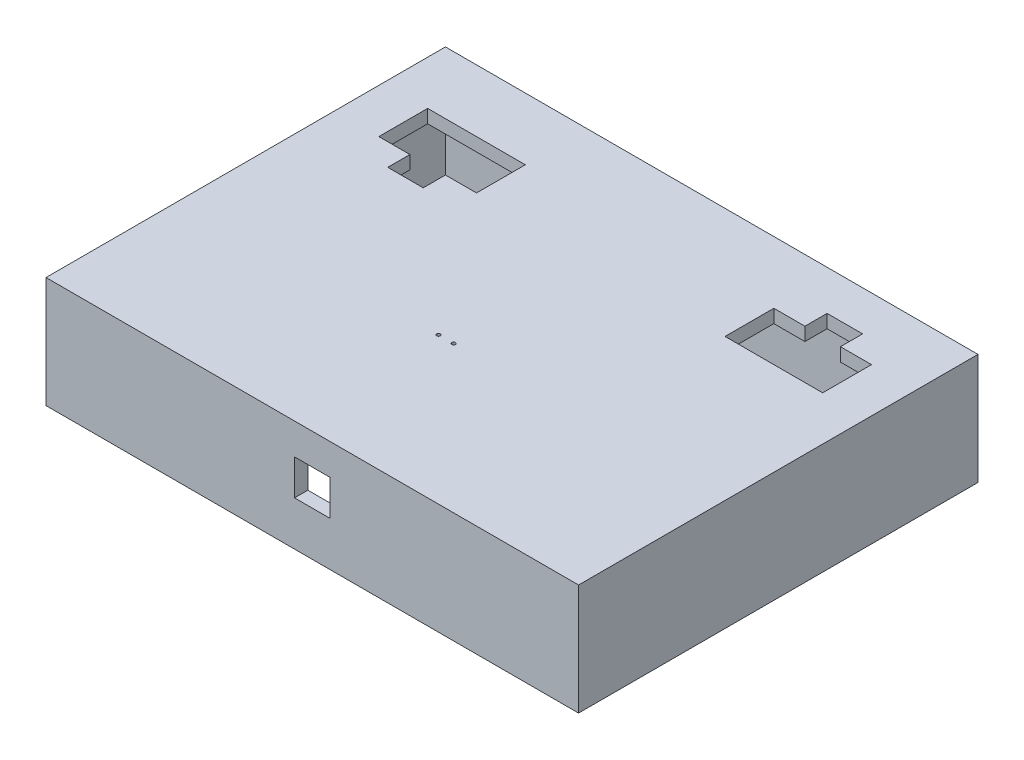
ISO-10303-21;
HEADER;
FILE_DESCRIPTION(('STEP AP214'),'2;1');
FILE_NAME('part.step','',(''),(''),'','','');
FILE_SCHEMA(('AUTOMOTIVE_DESIGN { 1 0 10303 214 1 1 1 1 }'));
ENDSEC;
DATA;
#1=APPLICATION_CONTEXT('core data for automotive mechanical design processes');
#2=APPLICATION_PROTOCOL_DEFINITION('international standard','automotive_design',2000,#1);
#3=PRODUCT_CONTEXT('',#1,'mechanical');
#4=PRODUCT('Part','Part','',(#3));
#5=PRODUCT_RELATED_PRODUCT_CATEGORY('part','',(#4));
#6=PRODUCT_DEFINITION_FORMATION('','',#4);
#7=PRODUCT_DEFINITION_CONTEXT('part definition',#1,'design');
#8=PRODUCT_DEFINITION('design','',#6,#7);
#9=PRODUCT_DEFINITION_SHAPE('','',#8);
#10=(LENGTH_UNIT() NAMED_UNIT(*) SI_UNIT(.MILLI.,.METRE.));
#11=(NAMED_UNIT(*) PLANE_ANGLE_UNIT() SI_UNIT($,.RADIAN.));
#12=(NAMED_UNIT(*) SI_UNIT($,.STERADIAN.) SOLID_ANGLE_UNIT());
#13=UNCERTAINTY_MEASURE_WITH_UNIT(LENGTH_MEASURE(1.E-05),#10,'distance_accuracy_value','');
#14=(GEOMETRIC_REPRESENTATION_CONTEXT(3) GLOBAL_UNCERTAINTY_ASSIGNED_CONTEXT((#13)) GLOBAL_UNIT_ASSIGNED_CONTEXT((#10,
#11,#12)) REPRESENTATION_CONTEXT('',''));
#15=CARTESIAN_POINT('',(0.,0.,0.));
#16=DIRECTION('',(0.,0.,1.));
#17=DIRECTION('',(1.,0.,0.));
#18=AXIS2_PLACEMENT_3D('',#15,#16,#17);
#19=CARTESIAN_POINT('',(60.,25.,-45.));
#20=DIRECTION('',(-1.,0.,0.));
#21=DIRECTION('',(0.,0.,1.));
#22=AXIS2_PLACEMENT_3D('',#19,#20,#21);
#23=PLANE('',#22);
#24=DIRECTION('',(0.,0.,-1.));
#25=VECTOR('',#24,1.);
#26=CARTESIAN_POINT('',(60.,0.,-45.));
#27=LINE('',#26,#25);
#28=CARTESIAN_POINT('',(60.,0.,45.));
#29=VERTEX_POINT('',#28);
#30=CARTESIAN_POINT('',(60.,0.,-45.));
#31=VERTEX_POINT('',#30);
#32=EDGE_CURVE('E408',#29,#31,#27,.T.);
#33=ORIENTED_EDGE('',*,*,#32,.T.);
#34=DIRECTION('',(0.,-1.,0.));
#35=VECTOR('',#34,1.);
#36=CARTESIAN_POINT('',(60.,25.,-45.));
#37=LINE('',#36,#35);
#38=CARTESIAN_POINT('',(60.,25.,-45.));
#39=VERTEX_POINT('',#38);
#40=EDGE_CURVE('E443',#39,#31,#37,.T.);
#41=ORIENTED_EDGE('',*,*,#40,.F.);
#42=DIRECTION('',(0.,0.,-1.));
#43=VECTOR('',#42,1.);
#44=CARTESIAN_POINT('',(60.,25.,-45.));
#45=LINE('',#44,#43);
#46=CARTESIAN_POINT('',(60.,25.,45.));
#47=VERTEX_POINT('',#46);
#48=EDGE_CURVE('E417',#47,#39,#45,.T.);
#49=ORIENTED_EDGE('',*,*,#48,.F.);
#50=DIRECTION('',(0.,-1.,0.));
#51=VECTOR('',#50,1.);
#52=CARTESIAN_POINT('',(60.,25.,45.));
#53=LINE('',#52,#51);
#54=EDGE_CURVE('E427',#47,#29,#53,.T.);
#55=ORIENTED_EDGE('',*,*,#54,.T.);
#56=EDGE_LOOP('',(#33,#41,#49,#55));
#57=FACE_BOUND('',#56,.T.);
#58=ADVANCED_FACE('F33',(#57),#23,.F.);
#59=CARTESIAN_POINT('',(-60.,25.,-45.));
#60=DIRECTION('',(0.,0.,1.));
#61=DIRECTION('',(1.,0.,0.));
#62=AXIS2_PLACEMENT_3D('',#59,#60,#61);
#63=PLANE('',#62);
#64=DIRECTION('',(-1.,0.,0.));
#65=VECTOR('',#64,1.);
#66=CARTESIAN_POINT('',(-60.,0.,-45.));
#67=LINE('',#66,#65);
#68=CARTESIAN_POINT('',(-60.,0.,-45.));
#69=VERTEX_POINT('',#68);
#70=EDGE_CURVE('E430',#31,#69,#67,.T.);
#71=ORIENTED_EDGE('',*,*,#70,.T.);
#72=DIRECTION('',(0.,-1.,0.));
#73=VECTOR('',#72,1.);
#74=CARTESIAN_POINT('',(-60.,25.,-45.));
#75=LINE('',#74,#73);
#76=CARTESIAN_POINT('',(-60.,25.,-45.));
#77=VERTEX_POINT('',#76);
#78=EDGE_CURVE('E440',#77,#69,#75,.T.);
#79=ORIENTED_EDGE('',*,*,#78,.F.);
#80=DIRECTION('',(-1.,0.,0.));
#81=VECTOR('',#80,1.);
#82=CARTESIAN_POINT('',(-60.,25.,-45.));
#83=LINE('',#82,#81);
#84=EDGE_CURVE('E420',#39,#77,#83,.T.);
#85=ORIENTED_EDGE('',*,*,#84,.F.);
#86=ORIENTED_EDGE('',*,*,#40,.T.);
#87=EDGE_LOOP('',(#71,#79,#85,#86));
#88=FACE_BOUND('',#87,.T.);
#89=ADVANCED_FACE('F526',(#88),#63,.F.);
#90=CARTESIAN_POINT('',(-60.,25.,-45.));
#91=DIRECTION('',(1.,0.,0.));
#92=DIRECTION('',(0.,0.,-1.));
#93=AXIS2_PLACEMENT_3D('',#90,#91,#92);
#94=PLANE('',#93);
#95=DIRECTION('',(0.,0.,1.));
#96=VECTOR('',#95,1.);
#97=CARTESIAN_POINT('',(-60.,0.,-45.));
#98=LINE('',#97,#96);
#99=CARTESIAN_POINT('',(-60.,0.,45.));
#100=VERTEX_POINT('',#99);
#101=EDGE_CURVE('E432',#69,#100,#98,.T.);
#102=ORIENTED_EDGE('',*,*,#101,.T.);
#103=DIRECTION('',(0.,-1.,0.));
#104=VECTOR('',#103,1.);
#105=CARTESIAN_POINT('',(-60.,25.,45.));
#106=LINE('',#105,#104);
#107=CARTESIAN_POINT('',(-60.,25.,45.));
#108=VERTEX_POINT('',#107);
#109=EDGE_CURVE('E437',#108,#100,#106,.T.);
#110=ORIENTED_EDGE('',*,*,#109,.F.);
#111=DIRECTION('',(0.,0.,1.));
#112=VECTOR('',#111,1.);
#113=CARTESIAN_POINT('',(-60.,25.,-45.));
#114=LINE('',#113,#112);
#115=EDGE_CURVE('E423',#77,#108,#114,.T.);
#116=ORIENTED_EDGE('',*,*,#115,.F.);
#117=ORIENTED_EDGE('',*,*,#78,.T.);
#118=EDGE_LOOP('',(#102,#110,#116,#117));
#119=FACE_BOUND('',#118,.T.);
#120=ADVANCED_FACE('F531',(#119),#94,.F.);
#121=CARTESIAN_POINT('',(-60.,25.,45.));
#122=DIRECTION('',(0.,0.,-1.));
#123=DIRECTION('',(-1.,0.,0.));
#124=AXIS2_PLACEMENT_3D('',#121,#122,#123);
#125=PLANE('',#124);
#126=DIRECTION('',(-1.,0.,0.));
#127=VECTOR('',#126,1.);
#128=CARTESIAN_POINT('',(-4.,18.,45.));
#129=LINE('',#128,#127);
#130=CARTESIAN_POINT('',(3.99999999999999,18.,45.));
#131=VERTEX_POINT('',#130);
#132=CARTESIAN_POINT('',(-4.,18.,45.));
#133=VERTEX_POINT('',#132);
#134=EDGE_CURVE('E255',#131,#133,#129,.T.);
#135=ORIENTED_EDGE('',*,*,#134,.F.);
#136=DIRECTION('',(0.,1.,0.));
#137=VECTOR('',#136,1.);
#138=CARTESIAN_POINT('',(4.,18.,45.));
#139=LINE('',#138,#137);
#140=CARTESIAN_POINT('',(4.,10.,45.));
#141=VERTEX_POINT('',#140);
#142=EDGE_CURVE('E49',#141,#131,#139,.T.);
#143=ORIENTED_EDGE('',*,*,#142,.F.);
#144=DIRECTION('',(1.,0.,0.));
#145=VECTOR('',#144,1.);
#146=CARTESIAN_POINT('',(-4.,10.,45.));
#147=LINE('',#146,#145);
#148=CARTESIAN_POINT('',(-4.,10.,45.));
#149=VERTEX_POINT('',#148);
#150=EDGE_CURVE('E262',#149,#141,#147,.T.);
#151=ORIENTED_EDGE('',*,*,#150,.F.);
#152=DIRECTION('',(0.,-1.,0.));
#153=VECTOR('',#152,1.);
#154=CARTESIAN_POINT('',(-4.,18.,45.));
#155=LINE('',#154,#153);
#156=EDGE_CURVE('E246',#133,#149,#155,.T.);
#157=ORIENTED_EDGE('',*,*,#156,.F.);
#158=EDGE_LOOP('',(#135,#143,#151,#157));
#159=FACE_BOUND('',#158,.T.);
#160=DIRECTION('',(1.,0.,0.));
#161=VECTOR('',#160,1.);
#162=CARTESIAN_POINT('',(-60.,0.,45.));
#163=LINE('',#162,#161);
#164=EDGE_CURVE('E421',#100,#29,#163,.T.);
#165=ORIENTED_EDGE('',*,*,#164,.T.);
#166=ORIENTED_EDGE('',*,*,#54,.F.);
#167=DIRECTION('',(1.,0.,0.));
#168=VECTOR('',#167,1.);
#169=CARTESIAN_POINT('',(-60.,25.,45.));
#170=LINE('',#169,#168);
#171=EDGE_CURVE('E425',#108,#47,#170,.T.);
#172=ORIENTED_EDGE('',*,*,#171,.F.);
#173=ORIENTED_EDGE('',*,*,#109,.T.);
#174=EDGE_LOOP('',(#165,#166,#172,#173));
#175=FACE_BOUND('',#174,.T.);
#176=ADVANCED_FACE('F259',(#159,#175),#125,.F.);
#177=CARTESIAN_POINT('',(0.,25.,0.));
#178=DIRECTION('',(0.,1.,0.));
#179=DIRECTION('',(0.,0.,1.));
#180=AXIS2_PLACEMENT_3D('',#177,#178,#179);
#181=PLANE('',#180);
#182=CARTESIAN_POINT('',(-4.59237924999825,25.,11.959320963537));
#183=DIRECTION('',(0.,1.,0.));
#184=DIRECTION('',(0.,0.,1.));
#185=AXIS2_PLACEMENT_3D('',#182,#183,#184);
#186=CIRCLE('',#185,0.4);
#187=CARTESIAN_POINT('',(-4.59237924999825,25.,12.359320963537));
#188=VERTEX_POINT('',#187);
#189=EDGE_CURVE('E489',#188,#188,#186,.T.);
#190=ORIENTED_EDGE('',*,*,#189,.F.);
#191=EDGE_LOOP('',(#190));
#192=FACE_BOUND('',#191,.T.);
#193=CARTESIAN_POINT('',(-1.19237924999825,25.,11.959320963537));
#194=DIRECTION('',(0.,1.,0.));
#195=DIRECTION('',(0.,0.,1.));
#196=AXIS2_PLACEMENT_3D('',#193,#194,#195);
#197=CIRCLE('',#196,0.4);
#198=CARTESIAN_POINT('',(-1.19237924999825,25.,12.359320963537));
#199=VERTEX_POINT('',#198);
#200=EDGE_CURVE('E494',#199,#199,#197,.T.);
#201=ORIENTED_EDGE('',*,*,#200,.F.);
#202=EDGE_LOOP('',(#201));
#203=FACE_BOUND('',#202,.T.);
#204=DIRECTION('',(0.,0.,-1.));
#205=VECTOR('',#204,1.);
#206=CARTESIAN_POINT('',(50.,25.,-31.));
#207=LINE('',#206,#205);
#208=CARTESIAN_POINT('',(50.,25.,-20.));
#209=VERTEX_POINT('',#208);
#210=CARTESIAN_POINT('',(50.,25.,-31.));
#211=VERTEX_POINT('',#210);
#212=EDGE_CURVE('E272',#209,#211,#207,.T.);
#213=ORIENTED_EDGE('',*,*,#212,.F.);
#214=DIRECTION('',(1.,0.,0.));
#215=VECTOR('',#214,1.);
#216=CARTESIAN_POINT('',(28.,25.,-20.));
#217=LINE('',#216,#215);
#218=CARTESIAN_POINT('',(28.,25.,-20.));
#219=VERTEX_POINT('',#218);
#220=EDGE_CURVE('E293',#219,#209,#217,.T.);
#221=ORIENTED_EDGE('',*,*,#220,.F.);
#222=DIRECTION('',(0.,0.,1.));
#223=VECTOR('',#222,1.);
#224=CARTESIAN_POINT('',(28.,25.,-31.));
#225=LINE('',#224,#223);
#226=CARTESIAN_POINT('',(28.,25.,-31.));
#227=VERTEX_POINT('',#226);
#228=EDGE_CURVE('E290',#227,#219,#225,.T.);
#229=ORIENTED_EDGE('',*,*,#228,.F.);
#230=DIRECTION('',(-1.,0.,0.));
#231=VECTOR('',#230,1.);
#232=CARTESIAN_POINT('',(28.,25.,-31.));
#233=LINE('',#232,#231);
#234=CARTESIAN_POINT('',(35.,25.,-31.));
#235=VERTEX_POINT('',#234);
#236=EDGE_CURVE('E287',#235,#227,#233,.T.);
#237=ORIENTED_EDGE('',*,*,#236,.F.);
#238=DIRECTION('',(0.,0.,1.));
#239=VECTOR('',#238,1.);
#240=CARTESIAN_POINT('',(35.,25.,-36.));
#241=LINE('',#240,#239);
#242=CARTESIAN_POINT('',(35.,25.,-36.));
#243=VERTEX_POINT('',#242);
#244=EDGE_CURVE('E284',#243,#235,#241,.T.);
#245=ORIENTED_EDGE('',*,*,#244,.F.);
#246=DIRECTION('',(-1.,0.,0.));
#247=VECTOR('',#246,1.);
#248=CARTESIAN_POINT('',(35.,25.,-36.));
#249=LINE('',#248,#247);
#250=CARTESIAN_POINT('',(43.,25.,-36.));
#251=VERTEX_POINT('',#250);
#252=EDGE_CURVE('E281',#251,#243,#249,.T.);
#253=ORIENTED_EDGE('',*,*,#252,.F.);
#254=DIRECTION('',(0.,0.,-1.));
#255=VECTOR('',#254,1.);
#256=CARTESIAN_POINT('',(43.,25.,-36.));
#257=LINE('',#256,#255);
#258=CARTESIAN_POINT('',(43.,25.,-31.));
#259=VERTEX_POINT('',#258);
#260=EDGE_CURVE('E278',#259,#251,#257,.T.);
#261=ORIENTED_EDGE('',*,*,#260,.F.);
#262=DIRECTION('',(-1.,0.,0.));
#263=VECTOR('',#262,1.);
#264=CARTESIAN_POINT('',(43.,25.,-31.));
#265=LINE('',#264,#263);
#266=EDGE_CURVE('E274',#211,#259,#265,.T.);
#267=ORIENTED_EDGE('',*,*,#266,.F.);
#268=EDGE_LOOP('',(#213,#221,#229,#237,#245,#253,#261,#267));
#269=FACE_BOUND('',#268,.T.);
#270=DIRECTION('',(0.,0.,-1.));
#271=VECTOR('',#270,1.);
#272=CARTESIAN_POINT('',(-28.,25.,-31.));
#273=LINE('',#272,#271);
#274=CARTESIAN_POINT('',(-28.,25.,-20.));
#275=VERTEX_POINT('',#274);
#276=CARTESIAN_POINT('',(-28.,25.,-31.));
#277=VERTEX_POINT('',#276);
#278=EDGE_CURVE('E269',#275,#277,#273,.T.);
#279=ORIENTED_EDGE('',*,*,#278,.F.);
#280=DIRECTION('',(1.,0.,0.));
#281=VECTOR('',#280,1.);
#282=CARTESIAN_POINT('',(-28.,25.,-20.));
#283=LINE('',#282,#281);
#284=CARTESIAN_POINT('',(-35.,25.,-20.));
#285=VERTEX_POINT('',#284);
#286=EDGE_CURVE('E333',#285,#275,#283,.T.);
#287=ORIENTED_EDGE('',*,*,#286,.F.);
#288=DIRECTION('',(0.,0.,-1.));
#289=VECTOR('',#288,1.);
#290=CARTESIAN_POINT('',(-35.,25.,-20.));
#291=LINE('',#290,#289);
#292=CARTESIAN_POINT('',(-35.,25.,-15.));
#293=VERTEX_POINT('',#292);
#294=EDGE_CURVE('E330',#293,#285,#291,.T.);
#295=ORIENTED_EDGE('',*,*,#294,.F.);
#296=DIRECTION('',(1.,0.,0.));
#297=VECTOR('',#296,1.);
#298=CARTESIAN_POINT('',(-43.,25.,-15.));
#299=LINE('',#298,#297);
#300=CARTESIAN_POINT('',(-43.,25.,-15.));
#301=VERTEX_POINT('',#300);
#302=EDGE_CURVE('E327',#301,#293,#299,.T.);
#303=ORIENTED_EDGE('',*,*,#302,.F.);
#304=DIRECTION('',(0.,0.,1.));
#305=VECTOR('',#304,1.);
#306=CARTESIAN_POINT('',(-43.,25.,-20.));
#307=LINE('',#306,#305);
#308=CARTESIAN_POINT('',(-43.,25.,-20.));
#309=VERTEX_POINT('',#308);
#310=EDGE_CURVE('E324',#309,#301,#307,.T.);
#311=ORIENTED_EDGE('',*,*,#310,.F.);
#312=DIRECTION('',(1.,0.,0.));
#313=VECTOR('',#312,1.);
#314=CARTESIAN_POINT('',(-43.,25.,-20.));
#315=LINE('',#314,#313);
#316=CARTESIAN_POINT('',(-50.,25.,-20.));
#317=VERTEX_POINT('',#316);
#318=EDGE_CURVE('E321',#317,#309,#315,.T.);
#319=ORIENTED_EDGE('',*,*,#318,.F.);
#320=DIRECTION('',(0.,0.,1.));
#321=VECTOR('',#320,1.);
#322=CARTESIAN_POINT('',(-50.,25.,-31.));
#323=LINE('',#322,#321);
#324=CARTESIAN_POINT('',(-50.,25.,-31.));
#325=VERTEX_POINT('',#324);
#326=EDGE_CURVE('E318',#325,#317,#323,.T.);
#327=ORIENTED_EDGE('',*,*,#326,.F.);
#328=DIRECTION('',(-1.,0.,0.));
#329=VECTOR('',#328,1.);
#330=CARTESIAN_POINT('',(-28.,25.,-31.));
#331=LINE('',#330,#329);
#332=EDGE_CURVE('E315',#277,#325,#331,.T.);
#333=ORIENTED_EDGE('',*,*,#332,.F.);
#334=EDGE_LOOP('',(#279,#287,#295,#303,#311,#319,#327,#333));
#335=FACE_BOUND('',#334,.T.);
#336=ORIENTED_EDGE('',*,*,#48,.T.);
#337=ORIENTED_EDGE('',*,*,#84,.T.);
#338=ORIENTED_EDGE('',*,*,#115,.T.);
#339=ORIENTED_EDGE('',*,*,#171,.T.);
#340=EDGE_LOOP('',(#336,#337,#338,#339));
#341=FACE_BOUND('',#340,.T.);
#342=ADVANCED_FACE('F504',(#192,#203,#269,#335,#341),#181,.T.);
#343=CARTESIAN_POINT('',(0.,0.,0.));
#344=DIRECTION('',(0.,1.,0.));
#345=DIRECTION('',(0.,0.,1.));
#346=AXIS2_PLACEMENT_3D('',#343,#344,#345);
#347=PLANE('',#346);
#348=DIRECTION('',(-1.,0.,0.));
#349=VECTOR('',#348,1.);
#350=CARTESIAN_POINT('',(-58.5,0.,43.5));
#351=LINE('',#350,#349);
#352=CARTESIAN_POINT('',(58.5,0.,43.5));
#353=VERTEX_POINT('',#352);
#354=CARTESIAN_POINT('',(-58.5,0.,43.5));
#355=VERTEX_POINT('',#354);
#356=EDGE_CURVE('E367',#353,#355,#351,.T.);
#357=ORIENTED_EDGE('',*,*,#356,.F.);
#358=DIRECTION('',(0.,0.,1.));
#359=VECTOR('',#358,1.);
#360=CARTESIAN_POINT('',(58.5,0.,-43.5));
#361=LINE('',#360,#359);
#362=CARTESIAN_POINT('',(58.5,0.,-43.5));
#363=VERTEX_POINT('',#362);
#364=EDGE_CURVE('E299',#363,#353,#361,.T.);
#365=ORIENTED_EDGE('',*,*,#364,.F.);
#366=DIRECTION('',(1.,0.,0.));
#367=VECTOR('',#366,1.);
#368=CARTESIAN_POINT('',(-58.5,0.,-43.5));
#369=LINE('',#368,#367);
#370=CARTESIAN_POINT('',(-58.5,0.,-43.5));
#371=VERTEX_POINT('',#370);
#372=EDGE_CURVE('E356',#371,#363,#369,.T.);
#373=ORIENTED_EDGE('',*,*,#372,.F.);
#374=DIRECTION('',(0.,0.,-1.));
#375=VECTOR('',#374,1.);
#376=CARTESIAN_POINT('',(-58.5,0.,-43.5));
#377=LINE('',#376,#375);
#378=EDGE_CURVE('E370',#355,#371,#377,.T.);
#379=ORIENTED_EDGE('',*,*,#378,.F.);
#380=EDGE_LOOP('',(#357,#365,#373,#379));
#381=FACE_BOUND('',#380,.T.);
#382=ORIENTED_EDGE('',*,*,#32,.F.);
#383=ORIENTED_EDGE('',*,*,#164,.F.);
#384=ORIENTED_EDGE('',*,*,#101,.F.);
#385=ORIENTED_EDGE('',*,*,#70,.F.);
#386=EDGE_LOOP('',(#382,#383,#384,#385));
#387=FACE_BOUND('',#386,.T.);
#388=ADVANCED_FACE('F507',(#381,#387),#347,.F.);
#389=CARTESIAN_POINT('',(0.,1.5,0.));
#390=DIRECTION('',(0.,1.,0.));
#391=DIRECTION('',(0.,0.,1.));
#392=AXIS2_PLACEMENT_3D('',#389,#390,#391);
#393=PLANE('',#392);
#394=DIRECTION('',(0.,0.,1.));
#395=VECTOR('',#394,1.);
#396=CARTESIAN_POINT('',(58.5,1.5,-43.5));
#397=LINE('',#396,#395);
#398=CARTESIAN_POINT('',(58.5,1.5,-43.5));
#399=VERTEX_POINT('',#398);
#400=CARTESIAN_POINT('',(58.5,1.5,43.5));
#401=VERTEX_POINT('',#400);
#402=EDGE_CURVE('E352',#399,#401,#397,.T.);
#403=ORIENTED_EDGE('',*,*,#402,.T.);
#404=DIRECTION('',(-1.,0.,0.));
#405=VECTOR('',#404,1.);
#406=CARTESIAN_POINT('',(-58.5,1.5,43.5));
#407=LINE('',#406,#405);
#408=CARTESIAN_POINT('',(-58.5,1.5,43.5));
#409=VERTEX_POINT('',#408);
#410=EDGE_CURVE('E355',#401,#409,#407,.T.);
#411=ORIENTED_EDGE('',*,*,#410,.T.);
#412=DIRECTION('',(0.,0.,-1.));
#413=VECTOR('',#412,1.);
#414=CARTESIAN_POINT('',(-58.5,1.5,-43.5));
#415=LINE('',#414,#413);
#416=CARTESIAN_POINT('',(-58.5,1.5,-43.5));
#417=VERTEX_POINT('',#416);
#418=EDGE_CURVE('E359',#409,#417,#415,.T.);
#419=ORIENTED_EDGE('',*,*,#418,.T.);
#420=DIRECTION('',(1.,0.,0.));
#421=VECTOR('',#420,1.);
#422=CARTESIAN_POINT('',(-58.5,1.5,-43.5));
#423=LINE('',#422,#421);
#424=EDGE_CURVE('E362',#417,#399,#423,.T.);
#425=ORIENTED_EDGE('',*,*,#424,.T.);
#426=EDGE_LOOP('',(#403,#411,#419,#425));
#427=FACE_BOUND('',#426,.T.);
#428=DIRECTION('',(1.,0.,0.));
#429=VECTOR('',#428,1.);
#430=CARTESIAN_POINT('',(-57.,1.5,-42.));
#431=LINE('',#430,#429);
#432=CARTESIAN_POINT('',(-57.,1.5,-42.));
#433=VERTEX_POINT('',#432);
#434=CARTESIAN_POINT('',(57.,1.5,-42.));
#435=VERTEX_POINT('',#434);
#436=EDGE_CURVE('E386',#433,#435,#431,.T.);
#437=ORIENTED_EDGE('',*,*,#436,.F.);
#438=DIRECTION('',(0.,0.,-1.));
#439=VECTOR('',#438,1.);
#440=CARTESIAN_POINT('',(-57.,1.5,42.));
#441=LINE('',#440,#439);
#442=CARTESIAN_POINT('',(-57.,1.5,42.));
#443=VERTEX_POINT('',#442);
#444=EDGE_CURVE('E377',#443,#433,#441,.T.);
#445=ORIENTED_EDGE('',*,*,#444,.F.);
#446=DIRECTION('',(-1.,0.,0.));
#447=VECTOR('',#446,1.);
#448=CARTESIAN_POINT('',(-57.,1.5,42.));
#449=LINE('',#448,#447);
#450=CARTESIAN_POINT('',(57.,1.5,42.));
#451=VERTEX_POINT('',#450);
#452=EDGE_CURVE('E446',#451,#443,#449,.T.);
#453=ORIENTED_EDGE('',*,*,#452,.F.);
#454=DIRECTION('',(0.,0.,1.));
#455=VECTOR('',#454,1.);
#456=CARTESIAN_POINT('',(57.,1.5,42.));
#457=LINE('',#456,#455);
#458=EDGE_CURVE('E389',#435,#451,#457,.T.);
#459=ORIENTED_EDGE('',*,*,#458,.F.);
#460=EDGE_LOOP('',(#437,#445,#453,#459));
#461=FACE_BOUND('',#460,.T.);
#462=ADVANCED_FACE('F535',(#427,#461),#393,.F.);
#463=CARTESIAN_POINT('',(58.5,1.5,-43.5));
#464=DIRECTION('',(1.,0.,0.));
#465=DIRECTION('',(0.,0.,-1.));
#466=AXIS2_PLACEMENT_3D('',#463,#464,#465);
#467=PLANE('',#466);
#468=ORIENTED_EDGE('',*,*,#364,.T.);
#469=DIRECTION('',(0.,-1.,0.));
#470=VECTOR('',#469,1.);
#471=CARTESIAN_POINT('',(58.5,1.5,43.5));
#472=LINE('',#471,#470);
#473=EDGE_CURVE('E365',#401,#353,#472,.T.);
#474=ORIENTED_EDGE('',*,*,#473,.F.);
#475=ORIENTED_EDGE('',*,*,#402,.F.);
#476=DIRECTION('',(0.,-1.,0.));
#477=VECTOR('',#476,1.);
#478=CARTESIAN_POINT('',(58.5,1.5,-43.5));
#479=LINE('',#478,#477);
#480=EDGE_CURVE('E375',#399,#363,#479,.T.);
#481=ORIENTED_EDGE('',*,*,#480,.T.);
#482=EDGE_LOOP('',(#468,#474,#475,#481));
#483=FACE_BOUND('',#482,.T.);
#484=ADVANCED_FACE('F541',(#483),#467,.F.);
#485=CARTESIAN_POINT('',(-58.5,1.5,-43.5));
#486=DIRECTION('',(0.,0.,-1.));
#487=DIRECTION('',(-1.,0.,0.));
#488=AXIS2_PLACEMENT_3D('',#485,#486,#487);
#489=PLANE('',#488);
#490=ORIENTED_EDGE('',*,*,#372,.T.);
#491=ORIENTED_EDGE('',*,*,#480,.F.);
#492=ORIENTED_EDGE('',*,*,#424,.F.);
#493=DIRECTION('',(0.,-1.,0.));
#494=VECTOR('',#493,1.);
#495=CARTESIAN_POINT('',(-58.5,1.5,-43.5));
#496=LINE('',#495,#494);
#497=EDGE_CURVE('E378',#417,#371,#496,.T.);
#498=ORIENTED_EDGE('',*,*,#497,.T.);
#499=EDGE_LOOP('',(#490,#491,#492,#498));
#500=FACE_BOUND('',#499,.T.);
#501=ADVANCED_FACE('F685',(#500),#489,.F.);
#502=CARTESIAN_POINT('',(-58.5,1.5,-43.5));
#503=DIRECTION('',(-1.,0.,0.));
#504=DIRECTION('',(0.,0.,1.));
#505=AXIS2_PLACEMENT_3D('',#502,#503,#504);
#506=PLANE('',#505);
#507=ORIENTED_EDGE('',*,*,#378,.T.);
#508=ORIENTED_EDGE('',*,*,#497,.F.);
#509=ORIENTED_EDGE('',*,*,#418,.F.);
#510=DIRECTION('',(0.,-1.,0.));
#511=VECTOR('',#510,1.);
#512=CARTESIAN_POINT('',(-58.5,1.5,43.5));
#513=LINE('',#512,#511);
#514=EDGE_CURVE('E380',#409,#355,#513,.T.);
#515=ORIENTED_EDGE('',*,*,#514,.T.);
#516=EDGE_LOOP('',(#507,#508,#509,#515));
#517=FACE_BOUND('',#516,.T.);
#518=ADVANCED_FACE('F688',(#517),#506,.F.);
#519=CARTESIAN_POINT('',(-58.5,1.5,43.5));
#520=DIRECTION('',(0.,0.,1.));
#521=DIRECTION('',(1.,0.,0.));
#522=AXIS2_PLACEMENT_3D('',#519,#520,#521);
#523=PLANE('',#522);
#524=ORIENTED_EDGE('',*,*,#356,.T.);
#525=ORIENTED_EDGE('',*,*,#514,.F.);
#526=ORIENTED_EDGE('',*,*,#410,.F.);
#527=ORIENTED_EDGE('',*,*,#473,.T.);
#528=EDGE_LOOP('',(#524,#525,#526,#527));
#529=FACE_BOUND('',#528,.T.);
#530=ADVANCED_FACE('F582',(#529),#523,.F.);
#531=CARTESIAN_POINT('',(0.,22.,0.));
#532=DIRECTION('',(0.,-1.,0.));
#533=DIRECTION('',(0.,0.,-1.));
#534=AXIS2_PLACEMENT_3D('',#531,#532,#533);
#535=PLANE('',#534);
#536=CARTESIAN_POINT('',(-4.59237924999825,22.,11.959320963537));
#537=DIRECTION('',(0.,-1.,0.));
#538=DIRECTION('',(0.,0.,-1.));
#539=AXIS2_PLACEMENT_3D('',#536,#537,#538);
#540=CIRCLE('',#539,0.4);
#541=CARTESIAN_POINT('',(-4.59237924999825,22.,11.559320963537));
#542=VERTEX_POINT('',#541);
#543=EDGE_CURVE('E36',#542,#542,#540,.T.);
#544=ORIENTED_EDGE('',*,*,#543,.F.);
#545=EDGE_LOOP('',(#544));
#546=FACE_BOUND('',#545,.T.);
#547=CARTESIAN_POINT('',(-1.19237924999825,22.,11.959320963537));
#548=DIRECTION('',(0.,-1.,0.));
#549=DIRECTION('',(0.,0.,-1.));
#550=AXIS2_PLACEMENT_3D('',#547,#548,#549);
#551=CIRCLE('',#550,0.4);
#552=CARTESIAN_POINT('',(-1.19237924999825,22.,11.559320963537));
#553=VERTEX_POINT('',#552);
#554=EDGE_CURVE('E487',#553,#553,#551,.T.);
#555=ORIENTED_EDGE('',*,*,#554,.F.);
#556=EDGE_LOOP('',(#555));
#557=FACE_BOUND('',#556,.T.);
#558=DIRECTION('',(0.,0.,1.));
#559=VECTOR('',#558,1.);
#560=CARTESIAN_POINT('',(50.,22.,0.));
#561=LINE('',#560,#559);
#562=CARTESIAN_POINT('',(50.,22.,-31.));
#563=VERTEX_POINT('',#562);
#564=CARTESIAN_POINT('',(50.,22.,-20.));
#565=VERTEX_POINT('',#564);
#566=EDGE_CURVE('E481',#563,#565,#561,.T.);
#567=ORIENTED_EDGE('',*,*,#566,.F.);
#568=DIRECTION('',(1.,0.,0.));
#569=VECTOR('',#568,1.);
#570=CARTESIAN_POINT('',(0.,22.,-31.));
#571=LINE('',#570,#569);
#572=CARTESIAN_POINT('',(43.,22.,-31.));
#573=VERTEX_POINT('',#572);
#574=EDGE_CURVE('E466',#573,#563,#571,.T.);
#575=ORIENTED_EDGE('',*,*,#574,.F.);
#576=DIRECTION('',(0.,0.,1.));
#577=VECTOR('',#576,1.);
#578=CARTESIAN_POINT('',(43.,22.,0.));
#579=LINE('',#578,#577);
#580=CARTESIAN_POINT('',(43.,22.,-36.));
#581=VERTEX_POINT('',#580);
#582=EDGE_CURVE('E468',#581,#573,#579,.T.);
#583=ORIENTED_EDGE('',*,*,#582,.F.);
#584=DIRECTION('',(1.,0.,0.));
#585=VECTOR('',#584,1.);
#586=CARTESIAN_POINT('',(0.,22.,-36.));
#587=LINE('',#586,#585);
#588=CARTESIAN_POINT('',(35.,22.,-36.));
#589=VERTEX_POINT('',#588);
#590=EDGE_CURVE('E471',#589,#581,#587,.T.);
#591=ORIENTED_EDGE('',*,*,#590,.F.);
#592=DIRECTION('',(0.,0.,-1.));
#593=VECTOR('',#592,1.);
#594=CARTESIAN_POINT('',(35.,22.,0.));
#595=LINE('',#594,#593);
#596=CARTESIAN_POINT('',(35.,22.,-31.));
#597=VERTEX_POINT('',#596);
#598=EDGE_CURVE('E473',#597,#589,#595,.T.);
#599=ORIENTED_EDGE('',*,*,#598,.F.);
#600=DIRECTION('',(1.,0.,0.));
#601=VECTOR('',#600,1.);
#602=CARTESIAN_POINT('',(0.,22.,-31.));
#603=LINE('',#602,#601);
#604=CARTESIAN_POINT('',(28.,22.,-31.));
#605=VERTEX_POINT('',#604);
#606=EDGE_CURVE('E475',#605,#597,#603,.T.);
#607=ORIENTED_EDGE('',*,*,#606,.F.);
#608=DIRECTION('',(0.,0.,-1.));
#609=VECTOR('',#608,1.);
#610=CARTESIAN_POINT('',(28.,22.,0.));
#611=LINE('',#610,#609);
#612=CARTESIAN_POINT('',(28.,22.,-20.));
#613=VERTEX_POINT('',#612);
#614=EDGE_CURVE('E477',#613,#605,#611,.T.);
#615=ORIENTED_EDGE('',*,*,#614,.F.);
#616=DIRECTION('',(-1.,0.,0.));
#617=VECTOR('',#616,1.);
#618=CARTESIAN_POINT('',(0.,22.,-20.));
#619=LINE('',#618,#617);
#620=EDGE_CURVE('E479',#565,#613,#619,.T.);
#621=ORIENTED_EDGE('',*,*,#620,.F.);
#622=EDGE_LOOP('',(#567,#575,#583,#591,#599,#607,#615,#621));
#623=FACE_BOUND('',#622,.T.);
#624=DIRECTION('',(0.,0.,1.));
#625=VECTOR('',#624,1.);
#626=CARTESIAN_POINT('',(-28.,22.,0.));
#627=LINE('',#626,#625);
#628=CARTESIAN_POINT('',(-28.,22.,-31.));
#629=VERTEX_POINT('',#628);
#630=CARTESIAN_POINT('',(-28.,22.,-20.));
#631=VERTEX_POINT('',#630);
#632=EDGE_CURVE('E464',#629,#631,#627,.T.);
#633=ORIENTED_EDGE('',*,*,#632,.F.);
#634=DIRECTION('',(1.,0.,0.));
#635=VECTOR('',#634,1.);
#636=CARTESIAN_POINT('',(0.,22.,-31.));
#637=LINE('',#636,#635);
#638=CARTESIAN_POINT('',(-50.,22.,-31.));
#639=VERTEX_POINT('',#638);
#640=EDGE_CURVE('E449',#639,#629,#637,.T.);
#641=ORIENTED_EDGE('',*,*,#640,.F.);
#642=DIRECTION('',(0.,0.,-1.));
#643=VECTOR('',#642,1.);
#644=CARTESIAN_POINT('',(-50.,22.,0.));
#645=LINE('',#644,#643);
#646=CARTESIAN_POINT('',(-50.,22.,-20.));
#647=VERTEX_POINT('',#646);
#648=EDGE_CURVE('E451',#647,#639,#645,.T.);
#649=ORIENTED_EDGE('',*,*,#648,.F.);
#650=DIRECTION('',(-1.,0.,0.));
#651=VECTOR('',#650,1.);
#652=CARTESIAN_POINT('',(0.,22.,-20.));
#653=LINE('',#652,#651);
#654=CARTESIAN_POINT('',(-43.,22.,-20.));
#655=VERTEX_POINT('',#654);
#656=EDGE_CURVE('E454',#655,#647,#653,.T.);
#657=ORIENTED_EDGE('',*,*,#656,.F.);
#658=DIRECTION('',(0.,0.,-1.));
#659=VECTOR('',#658,1.);
#660=CARTESIAN_POINT('',(-43.,22.,0.));
#661=LINE('',#660,#659);
#662=CARTESIAN_POINT('',(-43.,22.,-15.));
#663=VERTEX_POINT('',#662);
#664=EDGE_CURVE('E456',#663,#655,#661,.T.);
#665=ORIENTED_EDGE('',*,*,#664,.F.);
#666=DIRECTION('',(-1.,0.,0.));
#667=VECTOR('',#666,1.);
#668=CARTESIAN_POINT('',(0.,22.,-15.));
#669=LINE('',#668,#667);
#670=CARTESIAN_POINT('',(-35.,22.,-15.));
#671=VERTEX_POINT('',#670);
#672=EDGE_CURVE('E458',#671,#663,#669,.T.);
#673=ORIENTED_EDGE('',*,*,#672,.F.);
#674=DIRECTION('',(0.,0.,1.));
#675=VECTOR('',#674,1.);
#676=CARTESIAN_POINT('',(-35.,22.,0.));
#677=LINE('',#676,#675);
#678=CARTESIAN_POINT('',(-35.,22.,-20.));
#679=VERTEX_POINT('',#678);
#680=EDGE_CURVE('E460',#679,#671,#677,.T.);
#681=ORIENTED_EDGE('',*,*,#680,.F.);
#682=DIRECTION('',(-1.,0.,0.));
#683=VECTOR('',#682,1.);
#684=CARTESIAN_POINT('',(0.,22.,-20.));
#685=LINE('',#684,#683);
#686=EDGE_CURVE('E462',#631,#679,#685,.T.);
#687=ORIENTED_EDGE('',*,*,#686,.F.);
#688=EDGE_LOOP('',(#633,#641,#649,#657,#665,#673,#681,#687));
#689=FACE_BOUND('',#688,.T.);
#690=DIRECTION('',(0.,0.,1.));
#691=VECTOR('',#690,1.);
#692=CARTESIAN_POINT('',(57.,22.,42.));
#693=LINE('',#692,#691);
#694=CARTESIAN_POINT('',(57.,22.,-42.));
#695=VERTEX_POINT('',#694);
#696=CARTESIAN_POINT('',(57.,22.,42.));
#697=VERTEX_POINT('',#696);
#698=EDGE_CURVE('E392',#695,#697,#693,.T.);
#699=ORIENTED_EDGE('',*,*,#698,.T.);
#700=DIRECTION('',(-1.,0.,0.));
#701=VECTOR('',#700,1.);
#702=CARTESIAN_POINT('',(-57.,22.,42.));
#703=LINE('',#702,#701);
#704=CARTESIAN_POINT('',(-57.,22.,42.));
#705=VERTEX_POINT('',#704);
#706=EDGE_CURVE('E395',#697,#705,#703,.T.);
#707=ORIENTED_EDGE('',*,*,#706,.T.);
#708=DIRECTION('',(0.,0.,-1.));
#709=VECTOR('',#708,1.);
#710=CARTESIAN_POINT('',(-57.,22.,42.));
#711=LINE('',#710,#709);
#712=CARTESIAN_POINT('',(-57.,22.,-42.));
#713=VERTEX_POINT('',#712);
#714=EDGE_CURVE('E398',#705,#713,#711,.T.);
#715=ORIENTED_EDGE('',*,*,#714,.T.);
#716=DIRECTION('',(1.,0.,0.));
#717=VECTOR('',#716,1.);
#718=CARTESIAN_POINT('',(-57.,22.,-42.));
#719=LINE('',#718,#717);
#720=EDGE_CURVE('E401',#713,#695,#719,.T.);
#721=ORIENTED_EDGE('',*,*,#720,.T.);
#722=EDGE_LOOP('',(#699,#707,#715,#721));
#723=FACE_BOUND('',#722,.T.);
#724=ADVANCED_FACE('F576',(#546,#557,#623,#689,#723),#535,.T.);
#725=CARTESIAN_POINT('',(-57.,22.,42.));
#726=DIRECTION('',(0.,0.,1.));
#727=DIRECTION('',(1.,0.,0.));
#728=AXIS2_PLACEMENT_3D('',#725,#726,#727);
#729=PLANE('',#728);
#730=DIRECTION('',(1.,0.,0.));
#731=VECTOR('',#730,1.);
#732=CARTESIAN_POINT('',(-57.,10.,42.));
#733=LINE('',#732,#731);
#734=CARTESIAN_POINT('',(-4.,10.,42.));
#735=VERTEX_POINT('',#734);
#736=CARTESIAN_POINT('',(4.,10.,42.));
#737=VERTEX_POINT('',#736);
#738=EDGE_CURVE('E41',#735,#737,#733,.T.);
#739=ORIENTED_EDGE('',*,*,#738,.T.);
#740=DIRECTION('',(0.,1.,0.));
#741=VECTOR('',#740,1.);
#742=CARTESIAN_POINT('',(4.,22.,42.));
#743=LINE('',#742,#741);
#744=CARTESIAN_POINT('',(4.,18.,42.));
#745=VERTEX_POINT('',#744);
#746=EDGE_CURVE('E11',#737,#745,#743,.T.);
#747=ORIENTED_EDGE('',*,*,#746,.T.);
#748=DIRECTION('',(-1.,0.,0.));
#749=VECTOR('',#748,1.);
#750=CARTESIAN_POINT('',(-57.,18.,42.));
#751=LINE('',#750,#749);
#752=CARTESIAN_POINT('',(-4.,18.,42.));
#753=VERTEX_POINT('',#752);
#754=EDGE_CURVE('E483',#745,#753,#751,.T.);
#755=ORIENTED_EDGE('',*,*,#754,.T.);
#756=DIRECTION('',(0.,-1.,0.));
#757=VECTOR('',#756,1.);
#758=CARTESIAN_POINT('',(-4.,22.,42.));
#759=LINE('',#758,#757);
#760=EDGE_CURVE('E249',#753,#735,#759,.T.);
#761=ORIENTED_EDGE('',*,*,#760,.T.);
#762=EDGE_LOOP('',(#739,#747,#755,#761));
#763=FACE_BOUND('',#762,.T.);
#764=DIRECTION('',(0.,-1.,0.));
#765=VECTOR('',#764,1.);
#766=CARTESIAN_POINT('',(57.,22.,42.));
#767=LINE('',#766,#765);
#768=EDGE_CURVE('E404',#697,#451,#767,.T.);
#769=ORIENTED_EDGE('',*,*,#768,.T.);
#770=ORIENTED_EDGE('',*,*,#452,.T.);
#771=DIRECTION('',(0.,-1.,0.));
#772=VECTOR('',#771,1.);
#773=CARTESIAN_POINT('',(-57.,22.,42.));
#774=LINE('',#773,#772);
#775=EDGE_CURVE('E412',#705,#443,#774,.T.);
#776=ORIENTED_EDGE('',*,*,#775,.F.);
#777=ORIENTED_EDGE('',*,*,#706,.F.);
#778=EDGE_LOOP('',(#769,#770,#776,#777));
#779=FACE_BOUND('',#778,.T.);
#780=ADVANCED_FACE('F581',(#763,#779),#729,.F.);
#781=CARTESIAN_POINT('',(-57.,22.,42.));
#782=DIRECTION('',(-1.,0.,0.));
#783=DIRECTION('',(0.,0.,1.));
#784=AXIS2_PLACEMENT_3D('',#781,#782,#783);
#785=PLANE('',#784);
#786=ORIENTED_EDGE('',*,*,#775,.T.);
#787=ORIENTED_EDGE('',*,*,#444,.T.);
#788=DIRECTION('',(0.,-1.,0.));
#789=VECTOR('',#788,1.);
#790=CARTESIAN_POINT('',(-57.,22.,-42.));
#791=LINE('',#790,#789);
#792=EDGE_CURVE('E409',#713,#433,#791,.T.);
#793=ORIENTED_EDGE('',*,*,#792,.F.);
#794=ORIENTED_EDGE('',*,*,#714,.F.);
#795=EDGE_LOOP('',(#786,#787,#793,#794));
#796=FACE_BOUND('',#795,.T.);
#797=ADVANCED_FACE('F701',(#796),#785,.F.);
#798=CARTESIAN_POINT('',(-57.,22.,-42.));
#799=DIRECTION('',(0.,0.,-1.));
#800=DIRECTION('',(-1.,0.,0.));
#801=AXIS2_PLACEMENT_3D('',#798,#799,#800);
#802=PLANE('',#801);
#803=ORIENTED_EDGE('',*,*,#792,.T.);
#804=ORIENTED_EDGE('',*,*,#436,.T.);
#805=DIRECTION('',(0.,-1.,0.));
#806=VECTOR('',#805,1.);
#807=CARTESIAN_POINT('',(57.,22.,-42.));
#808=LINE('',#807,#806);
#809=EDGE_CURVE('E405',#695,#435,#808,.T.);
#810=ORIENTED_EDGE('',*,*,#809,.F.);
#811=ORIENTED_EDGE('',*,*,#720,.F.);
#812=EDGE_LOOP('',(#803,#804,#810,#811));
#813=FACE_BOUND('',#812,.T.);
#814=ADVANCED_FACE('F698',(#813),#802,.F.);
#815=CARTESIAN_POINT('',(57.,22.,42.));
#816=DIRECTION('',(1.,0.,0.));
#817=DIRECTION('',(0.,0.,-1.));
#818=AXIS2_PLACEMENT_3D('',#815,#816,#817);
#819=PLANE('',#818);
#820=ORIENTED_EDGE('',*,*,#809,.T.);
#821=ORIENTED_EDGE('',*,*,#458,.T.);
#822=ORIENTED_EDGE('',*,*,#768,.F.);
#823=ORIENTED_EDGE('',*,*,#698,.F.);
#824=EDGE_LOOP('',(#820,#821,#822,#823));
#825=FACE_BOUND('',#824,.T.);
#826=ADVANCED_FACE('F682',(#825),#819,.F.);
#827=CARTESIAN_POINT('',(-28.,13.5,-31.));
#828=DIRECTION('',(1.,0.,0.));
#829=DIRECTION('',(0.,0.,-1.));
#830=AXIS2_PLACEMENT_3D('',#827,#828,#829);
#831=PLANE('',#830);
#832=ORIENTED_EDGE('',*,*,#632,.T.);
#833=DIRECTION('',(0.,1.,0.));
#834=VECTOR('',#833,1.);
#835=CARTESIAN_POINT('',(-28.,13.5,-20.));
#836=LINE('',#835,#834);
#837=EDGE_CURVE('E275',#631,#275,#836,.T.);
#838=ORIENTED_EDGE('',*,*,#837,.T.);
#839=ORIENTED_EDGE('',*,*,#278,.T.);
#840=DIRECTION('',(0.,1.,0.));
#841=VECTOR('',#840,1.);
#842=CARTESIAN_POINT('',(-28.,13.5,-31.));
#843=LINE('',#842,#841);
#844=EDGE_CURVE('E336',#629,#277,#843,.T.);
#845=ORIENTED_EDGE('',*,*,#844,.F.);
#846=EDGE_LOOP('',(#832,#838,#839,#845));
#847=FACE_BOUND('',#846,.T.);
#848=ADVANCED_FACE('F657',(#847),#831,.F.);
#849=CARTESIAN_POINT('',(-28.,13.5,-20.));
#850=DIRECTION('',(0.,0.,1.));
#851=DIRECTION('',(1.,0.,0.));
#852=AXIS2_PLACEMENT_3D('',#849,#850,#851);
#853=PLANE('',#852);
#854=ORIENTED_EDGE('',*,*,#686,.T.);
#855=DIRECTION('',(0.,1.,0.));
#856=VECTOR('',#855,1.);
#857=CARTESIAN_POINT('',(-35.,13.5,-20.));
#858=LINE('',#857,#856);
#859=EDGE_CURVE('E338',#679,#285,#858,.T.);
#860=ORIENTED_EDGE('',*,*,#859,.T.);
#861=ORIENTED_EDGE('',*,*,#286,.T.);
#862=ORIENTED_EDGE('',*,*,#837,.F.);
#863=EDGE_LOOP('',(#854,#860,#861,#862));
#864=FACE_BOUND('',#863,.T.);
#865=ADVANCED_FACE('F653',(#864),#853,.F.);
#866=CARTESIAN_POINT('',(-35.,13.5,-20.));
#867=DIRECTION('',(1.,0.,0.));
#868=DIRECTION('',(0.,0.,-1.));
#869=AXIS2_PLACEMENT_3D('',#866,#867,#868);
#870=PLANE('',#869);
#871=ORIENTED_EDGE('',*,*,#680,.T.);
#872=DIRECTION('',(0.,1.,0.));
#873=VECTOR('',#872,1.);
#874=CARTESIAN_POINT('',(-35.,13.5,-15.));
#875=LINE('',#874,#873);
#876=EDGE_CURVE('E340',#671,#293,#875,.T.);
#877=ORIENTED_EDGE('',*,*,#876,.T.);
#878=ORIENTED_EDGE('',*,*,#294,.T.);
#879=ORIENTED_EDGE('',*,*,#859,.F.);
#880=EDGE_LOOP('',(#871,#877,#878,#879));
#881=FACE_BOUND('',#880,.T.);
#882=ADVANCED_FACE('F656',(#881),#870,.F.);
#883=CARTESIAN_POINT('',(-43.,13.5,-15.));
#884=DIRECTION('',(0.,0.,1.));
#885=DIRECTION('',(1.,0.,0.));
#886=AXIS2_PLACEMENT_3D('',#883,#884,#885);
#887=PLANE('',#886);
#888=ORIENTED_EDGE('',*,*,#672,.T.);
#889=DIRECTION('',(0.,1.,0.));
#890=VECTOR('',#889,1.);
#891=CARTESIAN_POINT('',(-43.,13.5,-15.));
#892=LINE('',#891,#890);
#893=EDGE_CURVE('E342',#663,#301,#892,.T.);
#894=ORIENTED_EDGE('',*,*,#893,.T.);
#895=ORIENTED_EDGE('',*,*,#302,.T.);
#896=ORIENTED_EDGE('',*,*,#876,.F.);
#897=EDGE_LOOP('',(#888,#894,#895,#896));
#898=FACE_BOUND('',#897,.T.);
#899=ADVANCED_FACE('F661',(#898),#887,.F.);
#900=CARTESIAN_POINT('',(-43.,13.5,-20.));
#901=DIRECTION('',(-1.,0.,0.));
#902=DIRECTION('',(0.,0.,1.));
#903=AXIS2_PLACEMENT_3D('',#900,#901,#902);
#904=PLANE('',#903);
#905=ORIENTED_EDGE('',*,*,#664,.T.);
#906=DIRECTION('',(0.,1.,0.));
#907=VECTOR('',#906,1.);
#908=CARTESIAN_POINT('',(-43.,13.5,-20.));
#909=LINE('',#908,#907);
#910=EDGE_CURVE('E344',#655,#309,#909,.T.);
#911=ORIENTED_EDGE('',*,*,#910,.T.);
#912=ORIENTED_EDGE('',*,*,#310,.T.);
#913=ORIENTED_EDGE('',*,*,#893,.F.);
#914=EDGE_LOOP('',(#905,#911,#912,#913));
#915=FACE_BOUND('',#914,.T.);
#916=ADVANCED_FACE('F665',(#915),#904,.F.);
#917=CARTESIAN_POINT('',(-43.,13.5,-20.));
#918=DIRECTION('',(0.,0.,1.));
#919=DIRECTION('',(1.,0.,0.));
#920=AXIS2_PLACEMENT_3D('',#917,#918,#919);
#921=PLANE('',#920);
#922=ORIENTED_EDGE('',*,*,#656,.T.);
#923=DIRECTION('',(0.,1.,0.));
#924=VECTOR('',#923,1.);
#925=CARTESIAN_POINT('',(-50.,13.5,-20.));
#926=LINE('',#925,#924);
#927=EDGE_CURVE('E346',#647,#317,#926,.T.);
#928=ORIENTED_EDGE('',*,*,#927,.T.);
#929=ORIENTED_EDGE('',*,*,#318,.T.);
#930=ORIENTED_EDGE('',*,*,#910,.F.);
#931=EDGE_LOOP('',(#922,#928,#929,#930));
#932=FACE_BOUND('',#931,.T.);
#933=ADVANCED_FACE('F669',(#932),#921,.F.);
#934=CARTESIAN_POINT('',(-50.,13.5,-31.));
#935=DIRECTION('',(-1.,0.,0.));
#936=DIRECTION('',(0.,0.,1.));
#937=AXIS2_PLACEMENT_3D('',#934,#935,#936);
#938=PLANE('',#937);
#939=ORIENTED_EDGE('',*,*,#648,.T.);
#940=DIRECTION('',(0.,1.,0.));
#941=VECTOR('',#940,1.);
#942=CARTESIAN_POINT('',(-50.,13.5,-31.));
#943=LINE('',#942,#941);
#944=EDGE_CURVE('E348',#639,#325,#943,.T.);
#945=ORIENTED_EDGE('',*,*,#944,.T.);
#946=ORIENTED_EDGE('',*,*,#326,.T.);
#947=ORIENTED_EDGE('',*,*,#927,.F.);
#948=EDGE_LOOP('',(#939,#945,#946,#947));
#949=FACE_BOUND('',#948,.T.);
#950=ADVANCED_FACE('F673',(#949),#938,.F.);
#951=CARTESIAN_POINT('',(-28.,13.5,-31.));
#952=DIRECTION('',(0.,0.,-1.));
#953=DIRECTION('',(-1.,0.,0.));
#954=AXIS2_PLACEMENT_3D('',#951,#952,#953);
#955=PLANE('',#954);
#956=ORIENTED_EDGE('',*,*,#640,.T.);
#957=ORIENTED_EDGE('',*,*,#844,.T.);
#958=ORIENTED_EDGE('',*,*,#332,.T.);
#959=ORIENTED_EDGE('',*,*,#944,.F.);
#960=EDGE_LOOP('',(#956,#957,#958,#959));
#961=FACE_BOUND('',#960,.T.);
#962=ADVANCED_FACE('F651',(#961),#955,.F.);
#963=CARTESIAN_POINT('',(50.,13.5,-31.));
#964=DIRECTION('',(1.,0.,0.));
#965=DIRECTION('',(0.,0.,-1.));
#966=AXIS2_PLACEMENT_3D('',#963,#964,#965);
#967=PLANE('',#966);
#968=ORIENTED_EDGE('',*,*,#566,.T.);
#969=DIRECTION('',(0.,1.,0.));
#970=VECTOR('',#969,1.);
#971=CARTESIAN_POINT('',(50.,13.5,-20.));
#972=LINE('',#971,#970);
#973=EDGE_CURVE('E297',#565,#209,#972,.T.);
#974=ORIENTED_EDGE('',*,*,#973,.T.);
#975=ORIENTED_EDGE('',*,*,#212,.T.);
#976=DIRECTION('',(0.,1.,0.));
#977=VECTOR('',#976,1.);
#978=CARTESIAN_POINT('',(50.,13.5,-31.));
#979=LINE('',#978,#977);
#980=EDGE_CURVE('E296',#563,#211,#979,.T.);
#981=ORIENTED_EDGE('',*,*,#980,.F.);
#982=EDGE_LOOP('',(#968,#974,#975,#981));
#983=FACE_BOUND('',#982,.T.);
#984=ADVANCED_FACE('F625',(#983),#967,.F.);
#985=CARTESIAN_POINT('',(28.,13.5,-20.));
#986=DIRECTION('',(0.,0.,1.));
#987=DIRECTION('',(1.,0.,0.));
#988=AXIS2_PLACEMENT_3D('',#985,#986,#987);
#989=PLANE('',#988);
#990=ORIENTED_EDGE('',*,*,#620,.T.);
#991=DIRECTION('',(0.,1.,0.));
#992=VECTOR('',#991,1.);
#993=CARTESIAN_POINT('',(28.,13.5,-20.));
#994=LINE('',#993,#992);
#995=EDGE_CURVE('E300',#613,#219,#994,.T.);
#996=ORIENTED_EDGE('',*,*,#995,.T.);
#997=ORIENTED_EDGE('',*,*,#220,.T.);
#998=ORIENTED_EDGE('',*,*,#973,.F.);
#999=EDGE_LOOP('',(#990,#996,#997,#998));
#1000=FACE_BOUND('',#999,.T.);
#1001=ADVANCED_FACE('F621',(#1000),#989,.F.);
#1002=CARTESIAN_POINT('',(28.,13.5,-31.));
#1003=DIRECTION('',(-1.,0.,0.));
#1004=DIRECTION('',(0.,0.,1.));
#1005=AXIS2_PLACEMENT_3D('',#1002,#1003,#1004);
#1006=PLANE('',#1005);
#1007=ORIENTED_EDGE('',*,*,#614,.T.);
#1008=DIRECTION('',(0.,1.,0.));
#1009=VECTOR('',#1008,1.);
#1010=CARTESIAN_POINT('',(28.,13.5,-31.));
#1011=LINE('',#1010,#1009);
#1012=EDGE_CURVE('E302',#605,#227,#1011,.T.);
#1013=ORIENTED_EDGE('',*,*,#1012,.T.);
#1014=ORIENTED_EDGE('',*,*,#228,.T.);
#1015=ORIENTED_EDGE('',*,*,#995,.F.);
#1016=EDGE_LOOP('',(#1007,#1013,#1014,#1015));
#1017=FACE_BOUND('',#1016,.T.);
#1018=ADVANCED_FACE('F624',(#1017),#1006,.F.);
#1019=CARTESIAN_POINT('',(28.,13.5,-31.));
#1020=DIRECTION('',(0.,0.,-1.));
#1021=DIRECTION('',(-1.,0.,0.));
#1022=AXIS2_PLACEMENT_3D('',#1019,#1020,#1021);
#1023=PLANE('',#1022);
#1024=ORIENTED_EDGE('',*,*,#606,.T.);
#1025=DIRECTION('',(0.,1.,0.));
#1026=VECTOR('',#1025,1.);
#1027=CARTESIAN_POINT('',(35.,13.5,-31.));
#1028=LINE('',#1027,#1026);
#1029=EDGE_CURVE('E304',#597,#235,#1028,.T.);
#1030=ORIENTED_EDGE('',*,*,#1029,.T.);
#1031=ORIENTED_EDGE('',*,*,#236,.T.);
#1032=ORIENTED_EDGE('',*,*,#1012,.F.);
#1033=EDGE_LOOP('',(#1024,#1030,#1031,#1032));
#1034=FACE_BOUND('',#1033,.T.);
#1035=ADVANCED_FACE('F629',(#1034),#1023,.F.);
#1036=CARTESIAN_POINT('',(35.,13.5,-36.));
#1037=DIRECTION('',(-1.,0.,0.));
#1038=DIRECTION('',(0.,0.,1.));
#1039=AXIS2_PLACEMENT_3D('',#1036,#1037,#1038);
#1040=PLANE('',#1039);
#1041=ORIENTED_EDGE('',*,*,#598,.T.);
#1042=DIRECTION('',(0.,1.,0.));
#1043=VECTOR('',#1042,1.);
#1044=CARTESIAN_POINT('',(35.,13.5,-36.));
#1045=LINE('',#1044,#1043);
#1046=EDGE_CURVE('E306',#589,#243,#1045,.T.);
#1047=ORIENTED_EDGE('',*,*,#1046,.T.);
#1048=ORIENTED_EDGE('',*,*,#244,.T.);
#1049=ORIENTED_EDGE('',*,*,#1029,.F.);
#1050=EDGE_LOOP('',(#1041,#1047,#1048,#1049));
#1051=FACE_BOUND('',#1050,.T.);
#1052=ADVANCED_FACE('F633',(#1051),#1040,.F.);
#1053=CARTESIAN_POINT('',(35.,13.5,-36.));
#1054=DIRECTION('',(0.,0.,-1.));
#1055=DIRECTION('',(-1.,0.,0.));
#1056=AXIS2_PLACEMENT_3D('',#1053,#1054,#1055);
#1057=PLANE('',#1056);
#1058=ORIENTED_EDGE('',*,*,#590,.T.);
#1059=DIRECTION('',(0.,1.,0.));
#1060=VECTOR('',#1059,1.);
#1061=CARTESIAN_POINT('',(43.,13.5,-36.));
#1062=LINE('',#1061,#1060);
#1063=EDGE_CURVE('E308',#581,#251,#1062,.T.);
#1064=ORIENTED_EDGE('',*,*,#1063,.T.);
#1065=ORIENTED_EDGE('',*,*,#252,.T.);
#1066=ORIENTED_EDGE('',*,*,#1046,.F.);
#1067=EDGE_LOOP('',(#1058,#1064,#1065,#1066));
#1068=FACE_BOUND('',#1067,.T.);
#1069=ADVANCED_FACE('F637',(#1068),#1057,.F.);
#1070=CARTESIAN_POINT('',(43.,13.5,-36.));
#1071=DIRECTION('',(1.,0.,0.));
#1072=DIRECTION('',(0.,0.,-1.));
#1073=AXIS2_PLACEMENT_3D('',#1070,#1071,#1072);
#1074=PLANE('',#1073);
#1075=ORIENTED_EDGE('',*,*,#582,.T.);
#1076=DIRECTION('',(0.,1.,0.));
#1077=VECTOR('',#1076,1.);
#1078=CARTESIAN_POINT('',(43.,13.5,-31.));
#1079=LINE('',#1078,#1077);
#1080=EDGE_CURVE('E310',#573,#259,#1079,.T.);
#1081=ORIENTED_EDGE('',*,*,#1080,.T.);
#1082=ORIENTED_EDGE('',*,*,#260,.T.);
#1083=ORIENTED_EDGE('',*,*,#1063,.F.);
#1084=EDGE_LOOP('',(#1075,#1081,#1082,#1083));
#1085=FACE_BOUND('',#1084,.T.);
#1086=ADVANCED_FACE('F641',(#1085),#1074,.F.);
#1087=CARTESIAN_POINT('',(43.,13.5,-31.));
#1088=DIRECTION('',(0.,0.,-1.));
#1089=DIRECTION('',(-1.,0.,0.));
#1090=AXIS2_PLACEMENT_3D('',#1087,#1088,#1089);
#1091=PLANE('',#1090);
#1092=ORIENTED_EDGE('',*,*,#574,.T.);
#1093=ORIENTED_EDGE('',*,*,#980,.T.);
#1094=ORIENTED_EDGE('',*,*,#266,.T.);
#1095=ORIENTED_EDGE('',*,*,#1080,.F.);
#1096=EDGE_LOOP('',(#1092,#1093,#1094,#1095));
#1097=FACE_BOUND('',#1096,.T.);
#1098=ADVANCED_FACE('F620',(#1097),#1091,.F.);
#1099=CARTESIAN_POINT('',(4.,18.,33.5));
#1100=DIRECTION('',(1.,0.,0.));
#1101=DIRECTION('',(0.,1.,0.));
#1102=AXIS2_PLACEMENT_3D('',#1099,#1100,#1101);
#1103=PLANE('',#1102);
#1104=DIRECTION('',(0.,0.,1.));
#1105=VECTOR('',#1104,1.);
#1106=CARTESIAN_POINT('',(4.,10.,33.5));
#1107=LINE('',#1106,#1105);
#1108=EDGE_CURVE('E267',#737,#141,#1107,.T.);
#1109=ORIENTED_EDGE('',*,*,#1108,.T.);
#1110=ORIENTED_EDGE('',*,*,#142,.T.);
#1111=DIRECTION('',(0.,0.,1.));
#1112=VECTOR('',#1111,1.);
#1113=CARTESIAN_POINT('',(4.,18.,33.5));
#1114=LINE('',#1113,#1112);
#1115=EDGE_CURVE('E252',#745,#131,#1114,.T.);
#1116=ORIENTED_EDGE('',*,*,#1115,.F.);
#1117=ORIENTED_EDGE('',*,*,#746,.F.);
#1118=EDGE_LOOP('',(#1109,#1110,#1116,#1117));
#1119=FACE_BOUND('',#1118,.T.);
#1120=ADVANCED_FACE('F613',(#1119),#1103,.F.);
#1121=CARTESIAN_POINT('',(-4.,10.,33.5));
#1122=DIRECTION('',(0.,-1.,0.));
#1123=DIRECTION('',(0.,0.,-1.));
#1124=AXIS2_PLACEMENT_3D('',#1121,#1122,#1123);
#1125=PLANE('',#1124);
#1126=DIRECTION('',(0.,0.,1.));
#1127=VECTOR('',#1126,1.);
#1128=CARTESIAN_POINT('',(-4.,10.,33.5));
#1129=LINE('',#1128,#1127);
#1130=EDGE_CURVE('E251',#735,#149,#1129,.T.);
#1131=ORIENTED_EDGE('',*,*,#1130,.T.);
#1132=ORIENTED_EDGE('',*,*,#150,.T.);
#1133=ORIENTED_EDGE('',*,*,#1108,.F.);
#1134=ORIENTED_EDGE('',*,*,#738,.F.);
#1135=EDGE_LOOP('',(#1131,#1132,#1133,#1134));
#1136=FACE_BOUND('',#1135,.T.);
#1137=ADVANCED_FACE('F610',(#1136),#1125,.F.);
#1138=CARTESIAN_POINT('',(-4.,18.,33.5));
#1139=DIRECTION('',(-1.,0.,0.));
#1140=DIRECTION('',(0.,-1.,0.));
#1141=AXIS2_PLACEMENT_3D('',#1138,#1139,#1140);
#1142=PLANE('',#1141);
#1143=DIRECTION('',(0.,0.,1.));
#1144=VECTOR('',#1143,1.);
#1145=CARTESIAN_POINT('',(-4.,18.,33.5));
#1146=LINE('',#1145,#1144);
#1147=EDGE_CURVE('E57',#753,#133,#1146,.T.);
#1148=ORIENTED_EDGE('',*,*,#1147,.T.);
#1149=ORIENTED_EDGE('',*,*,#156,.T.);
#1150=ORIENTED_EDGE('',*,*,#1130,.F.);
#1151=ORIENTED_EDGE('',*,*,#760,.F.);
#1152=EDGE_LOOP('',(#1148,#1149,#1150,#1151));
#1153=FACE_BOUND('',#1152,.T.);
#1154=ADVANCED_FACE('F243',(#1153),#1142,.F.);
#1155=CARTESIAN_POINT('',(-4.,18.,33.5));
#1156=DIRECTION('',(0.,1.,0.));
#1157=DIRECTION('',(0.,0.,1.));
#1158=AXIS2_PLACEMENT_3D('',#1155,#1156,#1157);
#1159=PLANE('',#1158);
#1160=ORIENTED_EDGE('',*,*,#1115,.T.);
#1161=ORIENTED_EDGE('',*,*,#134,.T.);
#1162=ORIENTED_EDGE('',*,*,#1147,.F.);
#1163=ORIENTED_EDGE('',*,*,#754,.F.);
#1164=EDGE_LOOP('',(#1160,#1161,#1162,#1163));
#1165=FACE_BOUND('',#1164,.T.);
#1166=ADVANCED_FACE('F256',(#1165),#1159,.F.);
#1167=CARTESIAN_POINT('',(-1.19237924999825,3.5,11.959320963537));
#1168=DIRECTION('',(0.,1.,0.));
#1169=DIRECTION('',(0.,0.,1.));
#1170=AXIS2_PLACEMENT_3D('',#1167,#1168,#1169);
#1171=CYLINDRICAL_SURFACE('',#1170,0.4);
#1172=ORIENTED_EDGE('',*,*,#554,.T.);
#1173=EDGE_LOOP('',(#1172));
#1174=FACE_BOUND('',#1173,.T.);
#1175=ORIENTED_EDGE('',*,*,#200,.T.);
#1176=EDGE_LOOP('',(#1175));
#1177=FACE_BOUND('',#1176,.T.);
#1178=ADVANCED_FACE('F502',(#1174,#1177),#1171,.F.);
#1179=CARTESIAN_POINT('',(-4.59237924999825,3.5,11.959320963537));
#1180=DIRECTION('',(0.,1.,0.));
#1181=DIRECTION('',(0.,0.,1.));
#1182=AXIS2_PLACEMENT_3D('',#1179,#1180,#1181);
#1183=CYLINDRICAL_SURFACE('',#1182,0.4);
#1184=ORIENTED_EDGE('',*,*,#543,.T.);
#1185=EDGE_LOOP('',(#1184));
#1186=FACE_BOUND('',#1185,.T.);
#1187=ORIENTED_EDGE('',*,*,#189,.T.);
#1188=EDGE_LOOP('',(#1187));
#1189=FACE_BOUND('',#1188,.T.);
#1190=ADVANCED_FACE('F596',(#1186,#1189),#1183,.F.);
#1191=CLOSED_SHELL('',(#58,#89,#120,#176,#342,#388,#462,#484,#501,#518,#530,#724,#780,#797,#814,
#826,#848,#865,#882,#899,#916,#933,#950,#962,#984,#1001,#1018,#1035,#1052,#1069,#1086,#1098,
#1120,#1137,#1154,#1166,#1178,#1190));
#1192=MANIFOLD_SOLID_BREP('B2',#1191);
#1193=ADVANCED_BREP_SHAPE_REPRESENTATION('',(#18,#1192),#14);
#1194=SHAPE_DEFINITION_REPRESENTATION(#9,#1193);
ENDSEC;
END-ISO-10303-21;
